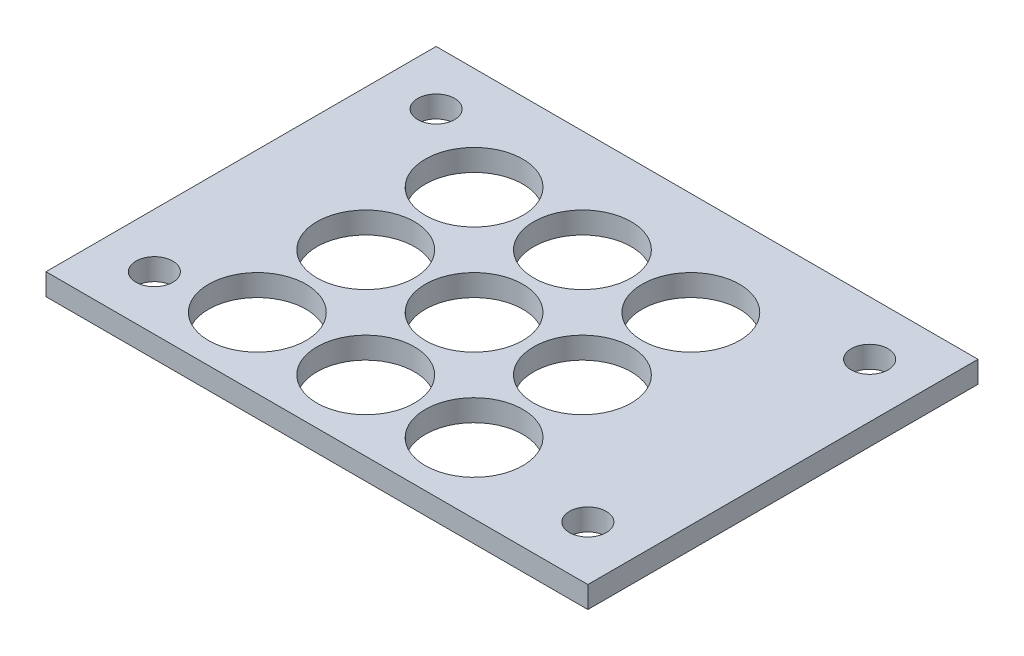
ISO-10303-21;
HEADER;
FILE_DESCRIPTION(('STEP AP214'),'2;1');
FILE_NAME('part.step','',(''),(''),'','','');
FILE_SCHEMA(('AUTOMOTIVE_DESIGN { 1 0 10303 214 1 1 1 1 }'));
ENDSEC;
DATA;
#1=APPLICATION_CONTEXT('core data for automotive mechanical design processes');
#2=APPLICATION_PROTOCOL_DEFINITION('international standard','automotive_design',2000,#1);
#3=PRODUCT_CONTEXT('',#1,'mechanical');
#4=PRODUCT('Part','Part','',(#3));
#5=PRODUCT_RELATED_PRODUCT_CATEGORY('part','',(#4));
#6=PRODUCT_DEFINITION_FORMATION('','',#4);
#7=PRODUCT_DEFINITION_CONTEXT('part definition',#1,'design');
#8=PRODUCT_DEFINITION('design','',#6,#7);
#9=PRODUCT_DEFINITION_SHAPE('','',#8);
#10=(LENGTH_UNIT() NAMED_UNIT(*) SI_UNIT(.MILLI.,.METRE.));
#11=(NAMED_UNIT(*) PLANE_ANGLE_UNIT() SI_UNIT($,.RADIAN.));
#12=(NAMED_UNIT(*) SI_UNIT($,.STERADIAN.) SOLID_ANGLE_UNIT());
#13=UNCERTAINTY_MEASURE_WITH_UNIT(LENGTH_MEASURE(1.E-05),#10,'distance_accuracy_value','');
#14=(GEOMETRIC_REPRESENTATION_CONTEXT(3) GLOBAL_UNCERTAINTY_ASSIGNED_CONTEXT((#13)) GLOBAL_UNIT_ASSIGNED_CONTEXT((#10,
#11,#12)) REPRESENTATION_CONTEXT('',''));
#15=CARTESIAN_POINT('',(0.,0.,0.));
#16=DIRECTION('',(0.,0.,1.));
#17=DIRECTION('',(1.,0.,0.));
#18=AXIS2_PLACEMENT_3D('',#15,#16,#17);
#19=CARTESIAN_POINT('',(0.,2.,0.));
#20=DIRECTION('',(0.,0.,-1.));
#21=DIRECTION('',(-1.,0.,0.));
#22=AXIS2_PLACEMENT_3D('',#19,#20,#21);
#23=PLANE('',#22);
#24=DIRECTION('',(1.,0.,0.));
#25=VECTOR('',#24,1.);
#26=CARTESIAN_POINT('',(0.,0.,0.));
#27=LINE('',#26,#25);
#28=CARTESIAN_POINT('',(0.,0.,0.));
#29=VERTEX_POINT('',#28);
#30=CARTESIAN_POINT('',(50.,0.,0.));
#31=VERTEX_POINT('',#30);
#32=EDGE_CURVE('E168',#29,#31,#27,.T.);
#33=ORIENTED_EDGE('',*,*,#32,.T.);
#34=DIRECTION('',(0.,-1.,0.));
#35=VECTOR('',#34,1.);
#36=CARTESIAN_POINT('',(50.,2.,0.));
#37=LINE('',#36,#35);
#38=CARTESIAN_POINT('',(50.,2.,0.));
#39=VERTEX_POINT('',#38);
#40=EDGE_CURVE('E11',#39,#31,#37,.T.);
#41=ORIENTED_EDGE('',*,*,#40,.F.);
#42=DIRECTION('',(1.,0.,0.));
#43=VECTOR('',#42,1.);
#44=CARTESIAN_POINT('',(0.,2.,0.));
#45=LINE('',#44,#43);
#46=CARTESIAN_POINT('',(0.,2.,0.));
#47=VERTEX_POINT('',#46);
#48=EDGE_CURVE('E98',#47,#39,#45,.T.);
#49=ORIENTED_EDGE('',*,*,#48,.F.);
#50=DIRECTION('',(0.,-1.,0.));
#51=VECTOR('',#50,1.);
#52=CARTESIAN_POINT('',(0.,2.,0.));
#53=LINE('',#52,#51);
#54=EDGE_CURVE('E65',#47,#29,#53,.T.);
#55=ORIENTED_EDGE('',*,*,#54,.T.);
#56=EDGE_LOOP('',(#33,#41,#49,#55));
#57=FACE_BOUND('',#56,.T.);
#58=ADVANCED_FACE('F47',(#57),#23,.F.);
#59=CARTESIAN_POINT('',(50.,2.,0.));
#60=DIRECTION('',(-1.,0.,0.));
#61=DIRECTION('',(0.,0.,1.));
#62=AXIS2_PLACEMENT_3D('',#59,#60,#61);
#63=PLANE('',#62);
#64=DIRECTION('',(0.,0.,-1.));
#65=VECTOR('',#64,1.);
#66=CARTESIAN_POINT('',(50.,0.,0.));
#67=LINE('',#66,#65);
#68=CARTESIAN_POINT('',(50.,0.,-36.));
#69=VERTEX_POINT('',#68);
#70=EDGE_CURVE('E104',#31,#69,#67,.T.);
#71=ORIENTED_EDGE('',*,*,#70,.T.);
#72=DIRECTION('',(0.,-1.,0.));
#73=VECTOR('',#72,1.);
#74=CARTESIAN_POINT('',(50.,2.,-36.));
#75=LINE('',#74,#73);
#76=CARTESIAN_POINT('',(50.,2.,-36.));
#77=VERTEX_POINT('',#76);
#78=EDGE_CURVE('E57',#77,#69,#75,.T.);
#79=ORIENTED_EDGE('',*,*,#78,.F.);
#80=DIRECTION('',(0.,0.,-1.));
#81=VECTOR('',#80,1.);
#82=CARTESIAN_POINT('',(50.,2.,0.));
#83=LINE('',#82,#81);
#84=EDGE_CURVE('E90',#39,#77,#83,.T.);
#85=ORIENTED_EDGE('',*,*,#84,.F.);
#86=ORIENTED_EDGE('',*,*,#40,.T.);
#87=EDGE_LOOP('',(#71,#79,#85,#86));
#88=FACE_BOUND('',#87,.T.);
#89=ADVANCED_FACE('F103',(#88),#63,.F.);
#90=CARTESIAN_POINT('',(0.,2.,-36.));
#91=DIRECTION('',(0.,0.,-1.));
#92=DIRECTION('',(-1.,0.,0.));
#93=AXIS2_PLACEMENT_3D('',#90,#91,#92);
#94=PLANE('',#93);
#95=DIRECTION('',(1.,0.,0.));
#96=VECTOR('',#95,1.);
#97=CARTESIAN_POINT('',(0.,0.,-36.));
#98=LINE('',#97,#96);
#99=CARTESIAN_POINT('',(0.,0.,-36.));
#100=VERTEX_POINT('',#99);
#101=EDGE_CURVE('E173',#100,#69,#98,.T.);
#102=ORIENTED_EDGE('',*,*,#101,.F.);
#103=DIRECTION('',(0.,-1.,0.));
#104=VECTOR('',#103,1.);
#105=CARTESIAN_POINT('',(0.,2.,-36.));
#106=LINE('',#105,#104);
#107=CARTESIAN_POINT('',(0.,2.,-36.));
#108=VERTEX_POINT('',#107);
#109=EDGE_CURVE('E79',#108,#100,#106,.T.);
#110=ORIENTED_EDGE('',*,*,#109,.F.);
#111=DIRECTION('',(1.,0.,0.));
#112=VECTOR('',#111,1.);
#113=CARTESIAN_POINT('',(0.,2.,-36.));
#114=LINE('',#113,#112);
#115=EDGE_CURVE('E97',#108,#77,#114,.T.);
#116=ORIENTED_EDGE('',*,*,#115,.T.);
#117=ORIENTED_EDGE('',*,*,#78,.T.);
#118=EDGE_LOOP('',(#102,#110,#116,#117));
#119=FACE_BOUND('',#118,.T.);
#120=ADVANCED_FACE('F108',(#119),#94,.T.);
#121=CARTESIAN_POINT('',(13.,2.,-6.5));
#122=DIRECTION('',(0.,-1.,0.));
#123=DIRECTION('',(0.,0.,-1.));
#124=AXIS2_PLACEMENT_3D('',#121,#122,#123);
#125=CYLINDRICAL_SURFACE('',#124,4.5);
#126=CARTESIAN_POINT('',(13.,2.,-6.5));
#127=DIRECTION('',(0.,1.,0.));
#128=DIRECTION('',(0.,0.,1.));
#129=AXIS2_PLACEMENT_3D('',#126,#127,#128);
#130=CIRCLE('',#129,4.5);
#131=CARTESIAN_POINT('',(13.,2.,-1.99999999999999));
#132=VERTEX_POINT('',#131);
#133=EDGE_CURVE('E235',#132,#132,#130,.T.);
#134=ORIENTED_EDGE('',*,*,#133,.T.);
#135=EDGE_LOOP('',(#134));
#136=FACE_BOUND('',#135,.T.);
#137=CARTESIAN_POINT('',(13.,0.,-6.5));
#138=DIRECTION('',(0.,1.,0.));
#139=DIRECTION('',(0.,0.,1.));
#140=AXIS2_PLACEMENT_3D('',#137,#138,#139);
#141=CIRCLE('',#140,4.5);
#142=CARTESIAN_POINT('',(13.,0.,-1.99999999999999));
#143=VERTEX_POINT('',#142);
#144=EDGE_CURVE('E164',#143,#143,#141,.T.);
#145=ORIENTED_EDGE('',*,*,#144,.F.);
#146=EDGE_LOOP('',(#145));
#147=FACE_BOUND('',#146,.T.);
#148=ADVANCED_FACE('F241',(#136,#147),#125,.F.);
#149=CARTESIAN_POINT('',(5.,2.,-5.));
#150=DIRECTION('',(0.,-1.,0.));
#151=DIRECTION('',(0.,0.,-1.));
#152=AXIS2_PLACEMENT_3D('',#149,#150,#151);
#153=CYLINDRICAL_SURFACE('',#152,1.7);
#154=CARTESIAN_POINT('',(5.,2.,-5.));
#155=DIRECTION('',(0.,1.,0.));
#156=DIRECTION('',(0.,0.,1.));
#157=AXIS2_PLACEMENT_3D('',#154,#155,#156);
#158=CIRCLE('',#157,1.7);
#159=CARTESIAN_POINT('',(5.,2.,-3.3));
#160=VERTEX_POINT('',#159);
#161=EDGE_CURVE('E231',#160,#160,#158,.T.);
#162=ORIENTED_EDGE('',*,*,#161,.T.);
#163=EDGE_LOOP('',(#162));
#164=FACE_BOUND('',#163,.T.);
#165=CARTESIAN_POINT('',(5.,0.,-5.));
#166=DIRECTION('',(0.,1.,0.));
#167=DIRECTION('',(0.,0.,1.));
#168=AXIS2_PLACEMENT_3D('',#165,#166,#167);
#169=CIRCLE('',#168,1.7);
#170=CARTESIAN_POINT('',(5.,0.,-3.3));
#171=VERTEX_POINT('',#170);
#172=EDGE_CURVE('E160',#171,#171,#169,.T.);
#173=ORIENTED_EDGE('',*,*,#172,.F.);
#174=EDGE_LOOP('',(#173));
#175=FACE_BOUND('',#174,.T.);
#176=ADVANCED_FACE('F267',(#164,#175),#153,.F.);
#177=CARTESIAN_POINT('',(5.,2.,-31.));
#178=DIRECTION('',(0.,-1.,0.));
#179=DIRECTION('',(0.,0.,-1.));
#180=AXIS2_PLACEMENT_3D('',#177,#178,#179);
#181=CYLINDRICAL_SURFACE('',#180,1.7);
#182=CARTESIAN_POINT('',(5.,2.,-31.));
#183=DIRECTION('',(0.,1.,0.));
#184=DIRECTION('',(0.,0.,1.));
#185=AXIS2_PLACEMENT_3D('',#182,#183,#184);
#186=CIRCLE('',#185,1.7);
#187=CARTESIAN_POINT('',(5.,2.,-29.3));
#188=VERTEX_POINT('',#187);
#189=EDGE_CURVE('E227',#188,#188,#186,.T.);
#190=ORIENTED_EDGE('',*,*,#189,.T.);
#191=EDGE_LOOP('',(#190));
#192=FACE_BOUND('',#191,.T.);
#193=CARTESIAN_POINT('',(5.,0.,-31.));
#194=DIRECTION('',(0.,1.,0.));
#195=DIRECTION('',(0.,0.,1.));
#196=AXIS2_PLACEMENT_3D('',#193,#194,#195);
#197=CIRCLE('',#196,1.7);
#198=CARTESIAN_POINT('',(5.,0.,-29.3));
#199=VERTEX_POINT('',#198);
#200=EDGE_CURVE('E156',#199,#199,#197,.T.);
#201=ORIENTED_EDGE('',*,*,#200,.F.);
#202=EDGE_LOOP('',(#201));
#203=FACE_BOUND('',#202,.T.);
#204=ADVANCED_FACE('F270',(#192,#203),#181,.F.);
#205=CARTESIAN_POINT('',(45.,2.,-31.));
#206=DIRECTION('',(0.,-1.,0.));
#207=DIRECTION('',(0.,0.,-1.));
#208=AXIS2_PLACEMENT_3D('',#205,#206,#207);
#209=CYLINDRICAL_SURFACE('',#208,1.7);
#210=CARTESIAN_POINT('',(45.,2.,-31.));
#211=DIRECTION('',(0.,1.,0.));
#212=DIRECTION('',(0.,0.,1.));
#213=AXIS2_PLACEMENT_3D('',#210,#211,#212);
#214=CIRCLE('',#213,1.7);
#215=CARTESIAN_POINT('',(45.,2.,-29.3));
#216=VERTEX_POINT('',#215);
#217=EDGE_CURVE('E223',#216,#216,#214,.T.);
#218=ORIENTED_EDGE('',*,*,#217,.T.);
#219=EDGE_LOOP('',(#218));
#220=FACE_BOUND('',#219,.T.);
#221=CARTESIAN_POINT('',(45.,0.,-31.));
#222=DIRECTION('',(0.,1.,0.));
#223=DIRECTION('',(0.,0.,1.));
#224=AXIS2_PLACEMENT_3D('',#221,#222,#223);
#225=CIRCLE('',#224,1.7);
#226=CARTESIAN_POINT('',(45.,0.,-29.3));
#227=VERTEX_POINT('',#226);
#228=EDGE_CURVE('E152',#227,#227,#225,.T.);
#229=ORIENTED_EDGE('',*,*,#228,.F.);
#230=EDGE_LOOP('',(#229));
#231=FACE_BOUND('',#230,.T.);
#232=ADVANCED_FACE('F274',(#220,#231),#209,.F.);
#233=CARTESIAN_POINT('',(45.,2.,-5.));
#234=DIRECTION('',(0.,-1.,0.));
#235=DIRECTION('',(0.,0.,-1.));
#236=AXIS2_PLACEMENT_3D('',#233,#234,#235);
#237=CYLINDRICAL_SURFACE('',#236,1.7);
#238=CARTESIAN_POINT('',(45.,2.,-5.));
#239=DIRECTION('',(0.,1.,0.));
#240=DIRECTION('',(0.,0.,1.));
#241=AXIS2_PLACEMENT_3D('',#238,#239,#240);
#242=CIRCLE('',#241,1.7);
#243=CARTESIAN_POINT('',(45.,2.,-3.3));
#244=VERTEX_POINT('',#243);
#245=EDGE_CURVE('E219',#244,#244,#242,.T.);
#246=ORIENTED_EDGE('',*,*,#245,.T.);
#247=EDGE_LOOP('',(#246));
#248=FACE_BOUND('',#247,.T.);
#249=CARTESIAN_POINT('',(45.,0.,-5.));
#250=DIRECTION('',(0.,1.,0.));
#251=DIRECTION('',(0.,0.,1.));
#252=AXIS2_PLACEMENT_3D('',#249,#250,#251);
#253=CIRCLE('',#252,1.7);
#254=CARTESIAN_POINT('',(45.,0.,-3.3));
#255=VERTEX_POINT('',#254);
#256=EDGE_CURVE('E148',#255,#255,#253,.T.);
#257=ORIENTED_EDGE('',*,*,#256,.F.);
#258=EDGE_LOOP('',(#257));
#259=FACE_BOUND('',#258,.T.);
#260=ADVANCED_FACE('F278',(#248,#259),#237,.F.);
#261=CARTESIAN_POINT('',(23.,2.,-6.5));
#262=DIRECTION('',(0.,-1.,0.));
#263=DIRECTION('',(0.,0.,-1.));
#264=AXIS2_PLACEMENT_3D('',#261,#262,#263);
#265=CYLINDRICAL_SURFACE('',#264,4.5);
#266=CARTESIAN_POINT('',(23.,2.,-6.5));
#267=DIRECTION('',(0.,1.,0.));
#268=DIRECTION('',(0.,0.,1.));
#269=AXIS2_PLACEMENT_3D('',#266,#267,#268);
#270=CIRCLE('',#269,4.5);
#271=CARTESIAN_POINT('',(23.,2.,-1.99999999999999));
#272=VERTEX_POINT('',#271);
#273=EDGE_CURVE('E215',#272,#272,#270,.T.);
#274=ORIENTED_EDGE('',*,*,#273,.T.);
#275=EDGE_LOOP('',(#274));
#276=FACE_BOUND('',#275,.T.);
#277=CARTESIAN_POINT('',(23.,0.,-6.5));
#278=DIRECTION('',(0.,1.,0.));
#279=DIRECTION('',(0.,0.,1.));
#280=AXIS2_PLACEMENT_3D('',#277,#278,#279);
#281=CIRCLE('',#280,4.5);
#282=CARTESIAN_POINT('',(23.,0.,-1.99999999999999));
#283=VERTEX_POINT('',#282);
#284=EDGE_CURVE('E144',#283,#283,#281,.T.);
#285=ORIENTED_EDGE('',*,*,#284,.F.);
#286=EDGE_LOOP('',(#285));
#287=FACE_BOUND('',#286,.T.);
#288=ADVANCED_FACE('F282',(#276,#287),#265,.F.);
#289=CARTESIAN_POINT('',(33.,2.,-6.5));
#290=DIRECTION('',(0.,-1.,0.));
#291=DIRECTION('',(0.,0.,-1.));
#292=AXIS2_PLACEMENT_3D('',#289,#290,#291);
#293=CYLINDRICAL_SURFACE('',#292,4.5);
#294=CARTESIAN_POINT('',(33.,2.,-6.5));
#295=DIRECTION('',(0.,1.,0.));
#296=DIRECTION('',(0.,0.,1.));
#297=AXIS2_PLACEMENT_3D('',#294,#295,#296);
#298=CIRCLE('',#297,4.5);
#299=CARTESIAN_POINT('',(33.,2.,-2.));
#300=VERTEX_POINT('',#299);
#301=EDGE_CURVE('E211',#300,#300,#298,.T.);
#302=ORIENTED_EDGE('',*,*,#301,.T.);
#303=EDGE_LOOP('',(#302));
#304=FACE_BOUND('',#303,.T.);
#305=CARTESIAN_POINT('',(33.,0.,-6.5));
#306=DIRECTION('',(0.,1.,0.));
#307=DIRECTION('',(0.,0.,1.));
#308=AXIS2_PLACEMENT_3D('',#305,#306,#307);
#309=CIRCLE('',#308,4.5);
#310=CARTESIAN_POINT('',(33.,0.,-2.));
#311=VERTEX_POINT('',#310);
#312=EDGE_CURVE('E140',#311,#311,#309,.T.);
#313=ORIENTED_EDGE('',*,*,#312,.F.);
#314=EDGE_LOOP('',(#313));
#315=FACE_BOUND('',#314,.T.);
#316=ADVANCED_FACE('F286',(#304,#315),#293,.F.);
#317=CARTESIAN_POINT('',(23.,2.,-16.5));
#318=DIRECTION('',(0.,-1.,0.));
#319=DIRECTION('',(0.,0.,-1.));
#320=AXIS2_PLACEMENT_3D('',#317,#318,#319);
#321=CYLINDRICAL_SURFACE('',#320,4.5);
#322=CARTESIAN_POINT('',(23.,2.,-16.5));
#323=DIRECTION('',(0.,1.,0.));
#324=DIRECTION('',(0.,0.,1.));
#325=AXIS2_PLACEMENT_3D('',#322,#323,#324);
#326=CIRCLE('',#325,4.5);
#327=CARTESIAN_POINT('',(23.,2.,-12.));
#328=VERTEX_POINT('',#327);
#329=EDGE_CURVE('E207',#328,#328,#326,.T.);
#330=ORIENTED_EDGE('',*,*,#329,.T.);
#331=EDGE_LOOP('',(#330));
#332=FACE_BOUND('',#331,.T.);
#333=CARTESIAN_POINT('',(23.,0.,-16.5));
#334=DIRECTION('',(0.,1.,0.));
#335=DIRECTION('',(0.,0.,1.));
#336=AXIS2_PLACEMENT_3D('',#333,#334,#335);
#337=CIRCLE('',#336,4.5);
#338=CARTESIAN_POINT('',(23.,0.,-12.));
#339=VERTEX_POINT('',#338);
#340=EDGE_CURVE('E136',#339,#339,#337,.T.);
#341=ORIENTED_EDGE('',*,*,#340,.F.);
#342=EDGE_LOOP('',(#341));
#343=FACE_BOUND('',#342,.T.);
#344=ADVANCED_FACE('F290',(#332,#343),#321,.F.);
#345=CARTESIAN_POINT('',(33.,2.,-16.5));
#346=DIRECTION('',(0.,-1.,0.));
#347=DIRECTION('',(0.,0.,-1.));
#348=AXIS2_PLACEMENT_3D('',#345,#346,#347);
#349=CYLINDRICAL_SURFACE('',#348,4.5);
#350=CARTESIAN_POINT('',(33.,2.,-16.5));
#351=DIRECTION('',(0.,1.,0.));
#352=DIRECTION('',(0.,0.,1.));
#353=AXIS2_PLACEMENT_3D('',#350,#351,#352);
#354=CIRCLE('',#353,4.5);
#355=CARTESIAN_POINT('',(33.,2.,-12.));
#356=VERTEX_POINT('',#355);
#357=EDGE_CURVE('E203',#356,#356,#354,.T.);
#358=ORIENTED_EDGE('',*,*,#357,.T.);
#359=EDGE_LOOP('',(#358));
#360=FACE_BOUND('',#359,.T.);
#361=CARTESIAN_POINT('',(33.,0.,-16.5));
#362=DIRECTION('',(0.,1.,0.));
#363=DIRECTION('',(0.,0.,1.));
#364=AXIS2_PLACEMENT_3D('',#361,#362,#363);
#365=CIRCLE('',#364,4.5);
#366=CARTESIAN_POINT('',(33.,0.,-12.));
#367=VERTEX_POINT('',#366);
#368=EDGE_CURVE('E132',#367,#367,#365,.T.);
#369=ORIENTED_EDGE('',*,*,#368,.F.);
#370=EDGE_LOOP('',(#369));
#371=FACE_BOUND('',#370,.T.);
#372=ADVANCED_FACE('F294',(#360,#371),#349,.F.);
#373=CARTESIAN_POINT('',(22.9999999999999,2.,-26.5));
#374=DIRECTION('',(0.,-1.,0.));
#375=DIRECTION('',(0.,0.,-1.));
#376=AXIS2_PLACEMENT_3D('',#373,#374,#375);
#377=CYLINDRICAL_SURFACE('',#376,4.5);
#378=CARTESIAN_POINT('',(22.9999999999999,2.,-26.5));
#379=DIRECTION('',(0.,1.,0.));
#380=DIRECTION('',(0.,0.,1.));
#381=AXIS2_PLACEMENT_3D('',#378,#379,#380);
#382=CIRCLE('',#381,4.5);
#383=CARTESIAN_POINT('',(22.9999999999999,2.,-22.));
#384=VERTEX_POINT('',#383);
#385=EDGE_CURVE('E199',#384,#384,#382,.T.);
#386=ORIENTED_EDGE('',*,*,#385,.T.);
#387=EDGE_LOOP('',(#386));
#388=FACE_BOUND('',#387,.T.);
#389=CARTESIAN_POINT('',(22.9999999999999,0.,-26.5));
#390=DIRECTION('',(0.,1.,0.));
#391=DIRECTION('',(0.,0.,1.));
#392=AXIS2_PLACEMENT_3D('',#389,#390,#391);
#393=CIRCLE('',#392,4.5);
#394=CARTESIAN_POINT('',(22.9999999999999,0.,-22.));
#395=VERTEX_POINT('',#394);
#396=EDGE_CURVE('E128',#395,#395,#393,.T.);
#397=ORIENTED_EDGE('',*,*,#396,.F.);
#398=EDGE_LOOP('',(#397));
#399=FACE_BOUND('',#398,.T.);
#400=ADVANCED_FACE('F298',(#388,#399),#377,.F.);
#401=CARTESIAN_POINT('',(32.9999999999999,2.,-26.5));
#402=DIRECTION('',(0.,-1.,0.));
#403=DIRECTION('',(0.,0.,-1.));
#404=AXIS2_PLACEMENT_3D('',#401,#402,#403);
#405=CYLINDRICAL_SURFACE('',#404,4.5);
#406=CARTESIAN_POINT('',(32.9999999999999,2.,-26.5));
#407=DIRECTION('',(0.,1.,0.));
#408=DIRECTION('',(0.,0.,1.));
#409=AXIS2_PLACEMENT_3D('',#406,#407,#408);
#410=CIRCLE('',#409,4.5);
#411=CARTESIAN_POINT('',(32.9999999999999,2.,-22.));
#412=VERTEX_POINT('',#411);
#413=EDGE_CURVE('E193',#412,#412,#410,.T.);
#414=ORIENTED_EDGE('',*,*,#413,.T.);
#415=EDGE_LOOP('',(#414));
#416=FACE_BOUND('',#415,.T.);
#417=CARTESIAN_POINT('',(32.9999999999999,0.,-26.5));
#418=DIRECTION('',(0.,1.,0.));
#419=DIRECTION('',(0.,0.,1.));
#420=AXIS2_PLACEMENT_3D('',#417,#418,#419);
#421=CIRCLE('',#420,4.5);
#422=CARTESIAN_POINT('',(32.9999999999999,0.,-22.));
#423=VERTEX_POINT('',#422);
#424=EDGE_CURVE('E124',#423,#423,#421,.T.);
#425=ORIENTED_EDGE('',*,*,#424,.F.);
#426=EDGE_LOOP('',(#425));
#427=FACE_BOUND('',#426,.T.);
#428=ADVANCED_FACE('F302',(#416,#427),#405,.F.);
#429=CARTESIAN_POINT('',(13.,2.,-16.5));
#430=DIRECTION('',(0.,-1.,0.));
#431=DIRECTION('',(0.,0.,-1.));
#432=AXIS2_PLACEMENT_3D('',#429,#430,#431);
#433=CYLINDRICAL_SURFACE('',#432,4.5);
#434=CARTESIAN_POINT('',(13.,2.,-16.5));
#435=DIRECTION('',(0.,1.,0.));
#436=DIRECTION('',(0.,0.,1.));
#437=AXIS2_PLACEMENT_3D('',#434,#435,#436);
#438=CIRCLE('',#437,4.5);
#439=CARTESIAN_POINT('',(13.,2.,-12.));
#440=VERTEX_POINT('',#439);
#441=EDGE_CURVE('E187',#440,#440,#438,.T.);
#442=ORIENTED_EDGE('',*,*,#441,.T.);
#443=EDGE_LOOP('',(#442));
#444=FACE_BOUND('',#443,.T.);
#445=CARTESIAN_POINT('',(13.,0.,-16.5));
#446=DIRECTION('',(0.,1.,0.));
#447=DIRECTION('',(0.,0.,1.));
#448=AXIS2_PLACEMENT_3D('',#445,#446,#447);
#449=CIRCLE('',#448,4.5);
#450=CARTESIAN_POINT('',(13.,0.,-12.));
#451=VERTEX_POINT('',#450);
#452=EDGE_CURVE('E120',#451,#451,#449,.T.);
#453=ORIENTED_EDGE('',*,*,#452,.F.);
#454=EDGE_LOOP('',(#453));
#455=FACE_BOUND('',#454,.T.);
#456=ADVANCED_FACE('F305',(#444,#455),#433,.F.);
#457=CARTESIAN_POINT('',(12.9999999999999,2.,-26.5));
#458=DIRECTION('',(0.,-1.,0.));
#459=DIRECTION('',(0.,0.,-1.));
#460=AXIS2_PLACEMENT_3D('',#457,#458,#459);
#461=CYLINDRICAL_SURFACE('',#460,4.5);
#462=CARTESIAN_POINT('',(12.9999999999999,2.,-26.5));
#463=DIRECTION('',(0.,1.,0.));
#464=DIRECTION('',(0.,0.,1.));
#465=AXIS2_PLACEMENT_3D('',#462,#463,#464);
#466=CIRCLE('',#465,4.5);
#467=CARTESIAN_POINT('',(12.9999999999999,2.,-22.));
#468=VERTEX_POINT('',#467);
#469=EDGE_CURVE('E180',#468,#468,#466,.T.);
#470=ORIENTED_EDGE('',*,*,#469,.T.);
#471=EDGE_LOOP('',(#470));
#472=FACE_BOUND('',#471,.T.);
#473=CARTESIAN_POINT('',(12.9999999999999,0.,-26.5));
#474=DIRECTION('',(0.,1.,0.));
#475=DIRECTION('',(0.,0.,1.));
#476=AXIS2_PLACEMENT_3D('',#473,#474,#475);
#477=CIRCLE('',#476,4.5);
#478=CARTESIAN_POINT('',(12.9999999999999,0.,-22.));
#479=VERTEX_POINT('',#478);
#480=EDGE_CURVE('E116',#479,#479,#477,.T.);
#481=ORIENTED_EDGE('',*,*,#480,.F.);
#482=EDGE_LOOP('',(#481));
#483=FACE_BOUND('',#482,.T.);
#484=ADVANCED_FACE('F49',(#472,#483),#461,.F.);
#485=CARTESIAN_POINT('',(0.,2.,0.));
#486=DIRECTION('',(-1.,0.,0.));
#487=DIRECTION('',(0.,0.,1.));
#488=AXIS2_PLACEMENT_3D('',#485,#486,#487);
#489=PLANE('',#488);
#490=DIRECTION('',(0.,0.,-1.));
#491=VECTOR('',#490,1.);
#492=CARTESIAN_POINT('',(0.,0.,0.));
#493=LINE('',#492,#491);
#494=EDGE_CURVE('E176',#29,#100,#493,.T.);
#495=ORIENTED_EDGE('',*,*,#494,.F.);
#496=ORIENTED_EDGE('',*,*,#54,.F.);
#497=DIRECTION('',(0.,0.,-1.));
#498=VECTOR('',#497,1.);
#499=CARTESIAN_POINT('',(0.,2.,0.));
#500=LINE('',#499,#498);
#501=EDGE_CURVE('E110',#47,#108,#500,.T.);
#502=ORIENTED_EDGE('',*,*,#501,.T.);
#503=ORIENTED_EDGE('',*,*,#109,.T.);
#504=EDGE_LOOP('',(#495,#496,#502,#503));
#505=FACE_BOUND('',#504,.T.);
#506=ADVANCED_FACE('F246',(#505),#489,.T.);
#507=CARTESIAN_POINT('',(0.,2.,0.));
#508=DIRECTION('',(0.,1.,0.));
#509=DIRECTION('',(0.,0.,1.));
#510=AXIS2_PLACEMENT_3D('',#507,#508,#509);
#511=PLANE('',#510);
#512=ORIENTED_EDGE('',*,*,#469,.F.);
#513=EDGE_LOOP('',(#512));
#514=FACE_BOUND('',#513,.T.);
#515=ORIENTED_EDGE('',*,*,#441,.F.);
#516=EDGE_LOOP('',(#515));
#517=FACE_BOUND('',#516,.T.);
#518=ORIENTED_EDGE('',*,*,#413,.F.);
#519=EDGE_LOOP('',(#518));
#520=FACE_BOUND('',#519,.T.);
#521=ORIENTED_EDGE('',*,*,#385,.F.);
#522=EDGE_LOOP('',(#521));
#523=FACE_BOUND('',#522,.T.);
#524=ORIENTED_EDGE('',*,*,#357,.F.);
#525=EDGE_LOOP('',(#524));
#526=FACE_BOUND('',#525,.T.);
#527=ORIENTED_EDGE('',*,*,#329,.F.);
#528=EDGE_LOOP('',(#527));
#529=FACE_BOUND('',#528,.T.);
#530=ORIENTED_EDGE('',*,*,#301,.F.);
#531=EDGE_LOOP('',(#530));
#532=FACE_BOUND('',#531,.T.);
#533=ORIENTED_EDGE('',*,*,#273,.F.);
#534=EDGE_LOOP('',(#533));
#535=FACE_BOUND('',#534,.T.);
#536=ORIENTED_EDGE('',*,*,#245,.F.);
#537=EDGE_LOOP('',(#536));
#538=FACE_BOUND('',#537,.T.);
#539=ORIENTED_EDGE('',*,*,#217,.F.);
#540=EDGE_LOOP('',(#539));
#541=FACE_BOUND('',#540,.T.);
#542=ORIENTED_EDGE('',*,*,#189,.F.);
#543=EDGE_LOOP('',(#542));
#544=FACE_BOUND('',#543,.T.);
#545=ORIENTED_EDGE('',*,*,#161,.F.);
#546=EDGE_LOOP('',(#545));
#547=FACE_BOUND('',#546,.T.);
#548=ORIENTED_EDGE('',*,*,#133,.F.);
#549=EDGE_LOOP('',(#548));
#550=FACE_BOUND('',#549,.T.);
#551=ORIENTED_EDGE('',*,*,#48,.T.);
#552=ORIENTED_EDGE('',*,*,#84,.T.);
#553=ORIENTED_EDGE('',*,*,#115,.F.);
#554=ORIENTED_EDGE('',*,*,#501,.F.);
#555=EDGE_LOOP('',(#551,#552,#553,#554));
#556=FACE_BOUND('',#555,.T.);
#557=ADVANCED_FACE('F94',(#514,#517,#520,#523,#526,#529,#532,#535,#538,#541,#544,#547,#550,
#556),#511,.T.);
#558=CARTESIAN_POINT('',(0.,0.,0.));
#559=DIRECTION('',(0.,1.,0.));
#560=DIRECTION('',(0.,0.,1.));
#561=AXIS2_PLACEMENT_3D('',#558,#559,#560);
#562=PLANE('',#561);
#563=ORIENTED_EDGE('',*,*,#480,.T.);
#564=EDGE_LOOP('',(#563));
#565=FACE_BOUND('',#564,.T.);
#566=ORIENTED_EDGE('',*,*,#452,.T.);
#567=EDGE_LOOP('',(#566));
#568=FACE_BOUND('',#567,.T.);
#569=ORIENTED_EDGE('',*,*,#424,.T.);
#570=EDGE_LOOP('',(#569));
#571=FACE_BOUND('',#570,.T.);
#572=ORIENTED_EDGE('',*,*,#396,.T.);
#573=EDGE_LOOP('',(#572));
#574=FACE_BOUND('',#573,.T.);
#575=ORIENTED_EDGE('',*,*,#368,.T.);
#576=EDGE_LOOP('',(#575));
#577=FACE_BOUND('',#576,.T.);
#578=ORIENTED_EDGE('',*,*,#340,.T.);
#579=EDGE_LOOP('',(#578));
#580=FACE_BOUND('',#579,.T.);
#581=ORIENTED_EDGE('',*,*,#312,.T.);
#582=EDGE_LOOP('',(#581));
#583=FACE_BOUND('',#582,.T.);
#584=ORIENTED_EDGE('',*,*,#284,.T.);
#585=EDGE_LOOP('',(#584));
#586=FACE_BOUND('',#585,.T.);
#587=ORIENTED_EDGE('',*,*,#256,.T.);
#588=EDGE_LOOP('',(#587));
#589=FACE_BOUND('',#588,.T.);
#590=ORIENTED_EDGE('',*,*,#228,.T.);
#591=EDGE_LOOP('',(#590));
#592=FACE_BOUND('',#591,.T.);
#593=ORIENTED_EDGE('',*,*,#200,.T.);
#594=EDGE_LOOP('',(#593));
#595=FACE_BOUND('',#594,.T.);
#596=ORIENTED_EDGE('',*,*,#172,.T.);
#597=EDGE_LOOP('',(#596));
#598=FACE_BOUND('',#597,.T.);
#599=ORIENTED_EDGE('',*,*,#144,.T.);
#600=EDGE_LOOP('',(#599));
#601=FACE_BOUND('',#600,.T.);
#602=ORIENTED_EDGE('',*,*,#32,.F.);
#603=ORIENTED_EDGE('',*,*,#494,.T.);
#604=ORIENTED_EDGE('',*,*,#101,.T.);
#605=ORIENTED_EDGE('',*,*,#70,.F.);
#606=EDGE_LOOP('',(#602,#603,#604,#605));
#607=FACE_BOUND('',#606,.T.);
#608=ADVANCED_FACE('F245',(#565,#568,#571,#574,#577,#580,#583,#586,#589,#592,#595,#598,#601,
#607),#562,.F.);
#609=CLOSED_SHELL('',(#58,#89,#120,#148,#176,#204,#232,#260,#288,#316,#344,#372,#400,#428,#456,
#484,#506,#557,#608));
#610=MANIFOLD_SOLID_BREP('B2',#609);
#611=ADVANCED_BREP_SHAPE_REPRESENTATION('',(#18,#610),#14);
#612=SHAPE_DEFINITION_REPRESENTATION(#9,#611);
ENDSEC;
END-ISO-10303-21;
